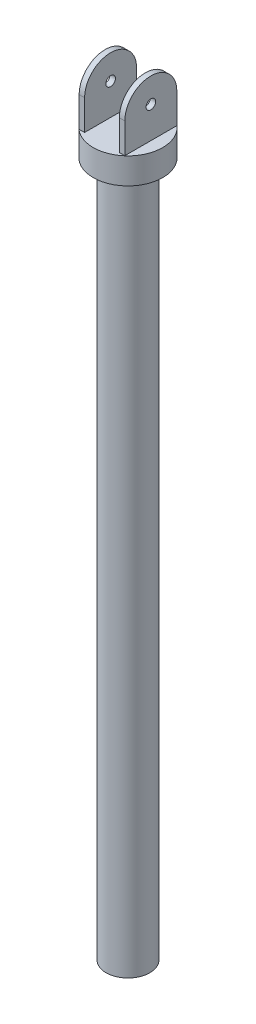
ISO-10303-21;
HEADER;
FILE_DESCRIPTION(('STEP AP214'),'2;1');
FILE_NAME('part.step','',(''),(''),'','','');
FILE_SCHEMA(('AUTOMOTIVE_DESIGN { 1 0 10303 214 1 1 1 1 }'));
ENDSEC;
DATA;
#1=APPLICATION_CONTEXT('core data for automotive mechanical design processes');
#2=APPLICATION_PROTOCOL_DEFINITION('international standard','automotive_design',2000,#1);
#3=PRODUCT_CONTEXT('',#1,'mechanical');
#4=PRODUCT('Part','Part','',(#3));
#5=PRODUCT_RELATED_PRODUCT_CATEGORY('part','',(#4));
#6=PRODUCT_DEFINITION_FORMATION('','',#4);
#7=PRODUCT_DEFINITION_CONTEXT('part definition',#1,'design');
#8=PRODUCT_DEFINITION('design','',#6,#7);
#9=PRODUCT_DEFINITION_SHAPE('','',#8);
#10=(LENGTH_UNIT() NAMED_UNIT(*) SI_UNIT(.MILLI.,.METRE.));
#11=(NAMED_UNIT(*) PLANE_ANGLE_UNIT() SI_UNIT($,.RADIAN.));
#12=(NAMED_UNIT(*) SI_UNIT($,.STERADIAN.) SOLID_ANGLE_UNIT());
#13=UNCERTAINTY_MEASURE_WITH_UNIT(LENGTH_MEASURE(1.E-05),#10,'distance_accuracy_value','');
#14=(GEOMETRIC_REPRESENTATION_CONTEXT(3) GLOBAL_UNCERTAINTY_ASSIGNED_CONTEXT((#13)) GLOBAL_UNIT_ASSIGNED_CONTEXT((#10,
#11,#12)) REPRESENTATION_CONTEXT('',''));
#15=CARTESIAN_POINT('',(0.,0.,0.));
#16=DIRECTION('',(0.,0.,1.));
#17=DIRECTION('',(1.,0.,0.));
#18=AXIS2_PLACEMENT_3D('',#15,#16,#17);
#19=CARTESIAN_POINT('',(0.,0.,0.));
#20=DIRECTION('',(0.,1.,0.));
#21=DIRECTION('',(0.,0.,1.));
#22=AXIS2_PLACEMENT_3D('',#19,#20,#21);
#23=PLANE('',#22);
#24=CARTESIAN_POINT('',(0.,0.,0.));
#25=DIRECTION('',(0.,1.,0.));
#26=DIRECTION('',(0.,0.,1.));
#27=AXIS2_PLACEMENT_3D('',#24,#25,#26);
#28=CIRCLE('',#27,25.4);
#29=CARTESIAN_POINT('',(0.,0.,25.4));
#30=VERTEX_POINT('',#29);
#31=EDGE_CURVE('E175',#30,#30,#28,.T.);
#32=ORIENTED_EDGE('',*,*,#31,.F.);
#33=EDGE_LOOP('',(#32));
#34=FACE_BOUND('',#33,.T.);
#35=CARTESIAN_POINT('',(0.,0.,0.));
#36=DIRECTION('',(0.,1.,0.));
#37=DIRECTION('',(0.,0.,1.));
#38=AXIS2_PLACEMENT_3D('',#35,#36,#37);
#39=CIRCLE('',#38,16.);
#40=CARTESIAN_POINT('',(0.,0.,16.));
#41=VERTEX_POINT('',#40);
#42=EDGE_CURVE('E11',#41,#41,#39,.F.);
#43=ORIENTED_EDGE('',*,*,#42,.F.);
#44=EDGE_LOOP('',(#43));
#45=FACE_BOUND('',#44,.T.);
#46=ADVANCED_FACE('F34',(#34,#45),#23,.F.);
#47=CARTESIAN_POINT('',(0.,19.05,0.));
#48=DIRECTION('',(0.,1.,0.));
#49=DIRECTION('',(0.,0.,1.));
#50=AXIS2_PLACEMENT_3D('',#47,#48,#49);
#51=PLANE('',#50);
#52=DIRECTION('',(0.,0.,-1.));
#53=VECTOR('',#52,1.);
#54=CARTESIAN_POINT('',(-16.7,19.05,19.));
#55=LINE('',#54,#53);
#56=CARTESIAN_POINT('',(-16.7,19.05,19.));
#57=VERTEX_POINT('',#56);
#58=CARTESIAN_POINT('',(-16.7,19.05,-19.));
#59=VERTEX_POINT('',#58);
#60=EDGE_CURVE('E117',#57,#59,#55,.T.);
#61=ORIENTED_EDGE('',*,*,#60,.T.);
#62=DIRECTION('',(1.,0.,0.));
#63=VECTOR('',#62,1.);
#64=CARTESIAN_POINT('',(-16.7,19.05,-19.));
#65=LINE('',#64,#63);
#66=CARTESIAN_POINT('',(-12.7,19.05,-19.));
#67=VERTEX_POINT('',#66);
#68=EDGE_CURVE('E138',#59,#67,#65,.T.);
#69=ORIENTED_EDGE('',*,*,#68,.T.);
#70=DIRECTION('',(0.,0.,-1.));
#71=VECTOR('',#70,1.);
#72=CARTESIAN_POINT('',(-12.7,19.05,19.));
#73=LINE('',#72,#71);
#74=CARTESIAN_POINT('',(-12.7,19.05,19.));
#75=VERTEX_POINT('',#74);
#76=EDGE_CURVE('E119',#75,#67,#73,.T.);
#77=ORIENTED_EDGE('',*,*,#76,.F.);
#78=DIRECTION('',(1.,0.,0.));
#79=VECTOR('',#78,1.);
#80=CARTESIAN_POINT('',(-16.7,19.05,19.));
#81=LINE('',#80,#79);
#82=EDGE_CURVE('E128',#57,#75,#81,.T.);
#83=ORIENTED_EDGE('',*,*,#82,.F.);
#84=EDGE_LOOP('',(#61,#69,#77,#83));
#85=FACE_BOUND('',#84,.T.);
#86=CARTESIAN_POINT('',(0.,19.05,0.));
#87=DIRECTION('',(0.,1.,0.));
#88=DIRECTION('',(0.,0.,1.));
#89=AXIS2_PLACEMENT_3D('',#86,#87,#88);
#90=CIRCLE('',#89,25.4);
#91=CARTESIAN_POINT('',(0.,19.05,25.4));
#92=VERTEX_POINT('',#91);
#93=EDGE_CURVE('E42',#92,#92,#90,.T.);
#94=ORIENTED_EDGE('',*,*,#93,.T.);
#95=EDGE_LOOP('',(#94));
#96=FACE_BOUND('',#95,.T.);
#97=DIRECTION('',(0.,0.,-1.));
#98=VECTOR('',#97,1.);
#99=CARTESIAN_POINT('',(16.7,19.05,19.));
#100=LINE('',#99,#98);
#101=CARTESIAN_POINT('',(16.7,19.05,19.));
#102=VERTEX_POINT('',#101);
#103=CARTESIAN_POINT('',(16.7,19.05,-19.));
#104=VERTEX_POINT('',#103);
#105=EDGE_CURVE('E150',#102,#104,#100,.T.);
#106=ORIENTED_EDGE('',*,*,#105,.F.);
#107=DIRECTION('',(-1.,0.,0.));
#108=VECTOR('',#107,1.);
#109=CARTESIAN_POINT('',(16.7,19.05,19.));
#110=LINE('',#109,#108);
#111=CARTESIAN_POINT('',(12.7,19.05,19.));
#112=VERTEX_POINT('',#111);
#113=EDGE_CURVE('E172',#102,#112,#110,.T.);
#114=ORIENTED_EDGE('',*,*,#113,.T.);
#115=DIRECTION('',(0.,0.,-1.));
#116=VECTOR('',#115,1.);
#117=CARTESIAN_POINT('',(12.7,19.05,19.));
#118=LINE('',#117,#116);
#119=CARTESIAN_POINT('',(12.7,19.05,-19.));
#120=VERTEX_POINT('',#119);
#121=EDGE_CURVE('E159',#112,#120,#118,.T.);
#122=ORIENTED_EDGE('',*,*,#121,.T.);
#123=DIRECTION('',(-1.,0.,0.));
#124=VECTOR('',#123,1.);
#125=CARTESIAN_POINT('',(16.7,19.05,-19.));
#126=LINE('',#125,#124);
#127=EDGE_CURVE('E170',#104,#120,#126,.T.);
#128=ORIENTED_EDGE('',*,*,#127,.F.);
#129=EDGE_LOOP('',(#106,#114,#122,#128));
#130=FACE_BOUND('',#129,.T.);
#131=ADVANCED_FACE('F183',(#85,#96,#130),#51,.T.);
#132=CARTESIAN_POINT('',(0.,19.05,0.));
#133=DIRECTION('',(0.,-1.,0.));
#134=DIRECTION('',(0.,0.,-1.));
#135=AXIS2_PLACEMENT_3D('',#132,#133,#134);
#136=CYLINDRICAL_SURFACE('',#135,25.4);
#137=ORIENTED_EDGE('',*,*,#93,.F.);
#138=EDGE_LOOP('',(#137));
#139=FACE_BOUND('',#138,.T.);
#140=ORIENTED_EDGE('',*,*,#31,.T.);
#141=EDGE_LOOP('',(#140));
#142=FACE_BOUND('',#141,.T.);
#143=ADVANCED_FACE('F36',(#139,#142),#136,.T.);
#144=CARTESIAN_POINT('',(16.7,41.05,0.));
#145=DIRECTION('',(1.,0.,0.));
#146=DIRECTION('',(0.,0.,-1.));
#147=AXIS2_PLACEMENT_3D('',#144,#145,#146);
#148=PLANE('',#147);
#149=DIRECTION('',(0.,-1.,0.));
#150=VECTOR('',#149,1.);
#151=CARTESIAN_POINT('',(16.7,41.05,19.));
#152=LINE('',#151,#150);
#153=CARTESIAN_POINT('',(16.7,41.05,19.));
#154=VERTEX_POINT('',#153);
#155=EDGE_CURVE('E148',#154,#102,#152,.T.);
#156=ORIENTED_EDGE('',*,*,#155,.T.);
#157=ORIENTED_EDGE('',*,*,#105,.T.);
#158=DIRECTION('',(0.,1.,0.));
#159=VECTOR('',#158,1.);
#160=CARTESIAN_POINT('',(16.7,19.05,-19.));
#161=LINE('',#160,#159);
#162=CARTESIAN_POINT('',(16.7,41.05,-19.));
#163=VERTEX_POINT('',#162);
#164=EDGE_CURVE('E57',#104,#163,#161,.T.);
#165=ORIENTED_EDGE('',*,*,#164,.T.);
#166=CARTESIAN_POINT('',(16.7,41.05,0.));
#167=DIRECTION('',(1.,0.,0.));
#168=DIRECTION('',(0.,0.,-1.));
#169=AXIS2_PLACEMENT_3D('',#166,#167,#168);
#170=CIRCLE('',#169,19.);
#171=EDGE_CURVE('E154',#163,#154,#170,.T.);
#172=ORIENTED_EDGE('',*,*,#171,.T.);
#173=EDGE_LOOP('',(#156,#157,#165,#172));
#174=FACE_BOUND('',#173,.T.);
#175=CARTESIAN_POINT('',(16.7,42.05,0.));
#176=DIRECTION('',(1.,0.,0.));
#177=DIRECTION('',(0.,0.,-1.));
#178=AXIS2_PLACEMENT_3D('',#175,#176,#177);
#179=CIRCLE('',#178,3.5);
#180=CARTESIAN_POINT('',(16.7,42.05,-3.5));
#181=VERTEX_POINT('',#180);
#182=EDGE_CURVE('E142',#181,#181,#179,.T.);
#183=ORIENTED_EDGE('',*,*,#182,.F.);
#184=EDGE_LOOP('',(#183));
#185=FACE_BOUND('',#184,.T.);
#186=ADVANCED_FACE('F222',(#174,#185),#148,.T.);
#187=CARTESIAN_POINT('',(12.7,41.05,0.));
#188=DIRECTION('',(1.,0.,0.));
#189=DIRECTION('',(0.,0.,-1.));
#190=AXIS2_PLACEMENT_3D('',#187,#188,#189);
#191=PLANE('',#190);
#192=DIRECTION('',(0.,-1.,0.));
#193=VECTOR('',#192,1.);
#194=CARTESIAN_POINT('',(12.7,41.05,19.));
#195=LINE('',#194,#193);
#196=CARTESIAN_POINT('',(12.7,41.05,19.));
#197=VERTEX_POINT('',#196);
#198=EDGE_CURVE('E145',#197,#112,#195,.T.);
#199=ORIENTED_EDGE('',*,*,#198,.F.);
#200=CARTESIAN_POINT('',(12.7,41.05,0.));
#201=DIRECTION('',(1.,0.,0.));
#202=DIRECTION('',(0.,0.,-1.));
#203=AXIS2_PLACEMENT_3D('',#200,#201,#202);
#204=CIRCLE('',#203,19.);
#205=CARTESIAN_POINT('',(12.7,41.05,-19.));
#206=VERTEX_POINT('',#205);
#207=EDGE_CURVE('E151',#206,#197,#204,.T.);
#208=ORIENTED_EDGE('',*,*,#207,.F.);
#209=DIRECTION('',(0.,1.,0.));
#210=VECTOR('',#209,1.);
#211=CARTESIAN_POINT('',(12.7,19.05,-19.));
#212=LINE('',#211,#210);
#213=EDGE_CURVE('E162',#120,#206,#212,.T.);
#214=ORIENTED_EDGE('',*,*,#213,.F.);
#215=ORIENTED_EDGE('',*,*,#121,.F.);
#216=EDGE_LOOP('',(#199,#208,#214,#215));
#217=FACE_BOUND('',#216,.T.);
#218=CARTESIAN_POINT('',(12.7,42.05,0.));
#219=DIRECTION('',(1.,0.,0.));
#220=DIRECTION('',(0.,0.,-1.));
#221=AXIS2_PLACEMENT_3D('',#218,#219,#220);
#222=CIRCLE('',#221,3.5);
#223=CARTESIAN_POINT('',(12.7,42.05,-3.5));
#224=VERTEX_POINT('',#223);
#225=EDGE_CURVE('E107',#224,#224,#222,.T.);
#226=ORIENTED_EDGE('',*,*,#225,.T.);
#227=EDGE_LOOP('',(#226));
#228=FACE_BOUND('',#227,.T.);
#229=ADVANCED_FACE('F225',(#217,#228),#191,.F.);
#230=CARTESIAN_POINT('',(16.7,41.05,19.));
#231=DIRECTION('',(0.,0.,-1.));
#232=DIRECTION('',(-1.,0.,0.));
#233=AXIS2_PLACEMENT_3D('',#230,#231,#232);
#234=PLANE('',#233);
#235=ORIENTED_EDGE('',*,*,#198,.T.);
#236=ORIENTED_EDGE('',*,*,#113,.F.);
#237=ORIENTED_EDGE('',*,*,#155,.F.);
#238=DIRECTION('',(-1.,0.,0.));
#239=VECTOR('',#238,1.);
#240=CARTESIAN_POINT('',(16.7,41.05,19.));
#241=LINE('',#240,#239);
#242=EDGE_CURVE('E156',#154,#197,#241,.T.);
#243=ORIENTED_EDGE('',*,*,#242,.T.);
#244=EDGE_LOOP('',(#235,#236,#237,#243));
#245=FACE_BOUND('',#244,.T.);
#246=ADVANCED_FACE('F229',(#245),#234,.F.);
#247=CARTESIAN_POINT('',(16.7,19.05,-19.));
#248=DIRECTION('',(0.,0.,1.));
#249=DIRECTION('',(1.,0.,0.));
#250=AXIS2_PLACEMENT_3D('',#247,#248,#249);
#251=PLANE('',#250);
#252=ORIENTED_EDGE('',*,*,#213,.T.);
#253=DIRECTION('',(-1.,0.,0.));
#254=VECTOR('',#253,1.);
#255=CARTESIAN_POINT('',(16.7,41.05,-19.));
#256=LINE('',#255,#254);
#257=EDGE_CURVE('E167',#163,#206,#256,.T.);
#258=ORIENTED_EDGE('',*,*,#257,.F.);
#259=ORIENTED_EDGE('',*,*,#164,.F.);
#260=ORIENTED_EDGE('',*,*,#127,.T.);
#261=EDGE_LOOP('',(#252,#258,#259,#260));
#262=FACE_BOUND('',#261,.T.);
#263=ADVANCED_FACE('F233',(#262),#251,.F.);
#264=CARTESIAN_POINT('',(16.7,41.05,0.));
#265=DIRECTION('',(-1.,0.,0.));
#266=DIRECTION('',(0.,0.,1.));
#267=AXIS2_PLACEMENT_3D('',#264,#265,#266);
#268=CYLINDRICAL_SURFACE('',#267,19.);
#269=ORIENTED_EDGE('',*,*,#207,.T.);
#270=ORIENTED_EDGE('',*,*,#242,.F.);
#271=ORIENTED_EDGE('',*,*,#171,.F.);
#272=ORIENTED_EDGE('',*,*,#257,.T.);
#273=EDGE_LOOP('',(#269,#270,#271,#272));
#274=FACE_BOUND('',#273,.T.);
#275=ADVANCED_FACE('F220',(#274),#268,.T.);
#276=CARTESIAN_POINT('',(16.7,42.05,0.));
#277=DIRECTION('',(-1.,0.,0.));
#278=DIRECTION('',(0.,0.,1.));
#279=AXIS2_PLACEMENT_3D('',#276,#277,#278);
#280=CYLINDRICAL_SURFACE('',#279,3.5);
#281=ORIENTED_EDGE('',*,*,#182,.T.);
#282=EDGE_LOOP('',(#281));
#283=FACE_BOUND('',#282,.T.);
#284=ORIENTED_EDGE('',*,*,#225,.F.);
#285=EDGE_LOOP('',(#284));
#286=FACE_BOUND('',#285,.T.);
#287=ADVANCED_FACE('F217',(#283,#286),#280,.F.);
#288=CARTESIAN_POINT('',(-16.7,41.05,19.));
#289=DIRECTION('',(0.,0.,1.));
#290=DIRECTION('',(1.,0.,0.));
#291=AXIS2_PLACEMENT_3D('',#288,#289,#290);
#292=PLANE('',#291);
#293=DIRECTION('',(0.,-1.,0.));
#294=VECTOR('',#293,1.);
#295=CARTESIAN_POINT('',(-12.7,41.05,19.));
#296=LINE('',#295,#294);
#297=CARTESIAN_POINT('',(-12.7,41.05,19.));
#298=VERTEX_POINT('',#297);
#299=EDGE_CURVE('E49',#298,#75,#296,.T.);
#300=ORIENTED_EDGE('',*,*,#299,.F.);
#301=DIRECTION('',(1.,0.,0.));
#302=VECTOR('',#301,1.);
#303=CARTESIAN_POINT('',(-16.7,41.05,19.));
#304=LINE('',#303,#302);
#305=CARTESIAN_POINT('',(-16.7,41.05,19.));
#306=VERTEX_POINT('',#305);
#307=EDGE_CURVE('E99',#306,#298,#304,.T.);
#308=ORIENTED_EDGE('',*,*,#307,.F.);
#309=DIRECTION('',(0.,-1.,0.));
#310=VECTOR('',#309,1.);
#311=CARTESIAN_POINT('',(-16.7,41.05,19.));
#312=LINE('',#311,#310);
#313=EDGE_CURVE('E102',#306,#57,#312,.T.);
#314=ORIENTED_EDGE('',*,*,#313,.T.);
#315=ORIENTED_EDGE('',*,*,#82,.T.);
#316=EDGE_LOOP('',(#300,#308,#314,#315));
#317=FACE_BOUND('',#316,.T.);
#318=ADVANCED_FACE('F101',(#317),#292,.T.);
#319=CARTESIAN_POINT('',(-16.7,41.05,0.));
#320=DIRECTION('',(1.,0.,0.));
#321=DIRECTION('',(0.,0.,-1.));
#322=AXIS2_PLACEMENT_3D('',#319,#320,#321);
#323=CYLINDRICAL_SURFACE('',#322,19.);
#324=CARTESIAN_POINT('',(-12.7,41.05,0.));
#325=DIRECTION('',(1.,0.,0.));
#326=DIRECTION('',(0.,0.,-1.));
#327=AXIS2_PLACEMENT_3D('',#324,#325,#326);
#328=CIRCLE('',#327,19.);
#329=CARTESIAN_POINT('',(-12.7,41.05,-19.));
#330=VERTEX_POINT('',#329);
#331=EDGE_CURVE('E130',#330,#298,#328,.T.);
#332=ORIENTED_EDGE('',*,*,#331,.F.);
#333=DIRECTION('',(1.,0.,0.));
#334=VECTOR('',#333,1.);
#335=CARTESIAN_POINT('',(-16.7,41.05,-19.));
#336=LINE('',#335,#334);
#337=CARTESIAN_POINT('',(-16.7,41.05,-19.));
#338=VERTEX_POINT('',#337);
#339=EDGE_CURVE('E108',#338,#330,#336,.T.);
#340=ORIENTED_EDGE('',*,*,#339,.F.);
#341=CARTESIAN_POINT('',(-16.7,41.05,0.));
#342=DIRECTION('',(1.,0.,0.));
#343=DIRECTION('',(0.,0.,-1.));
#344=AXIS2_PLACEMENT_3D('',#341,#342,#343);
#345=CIRCLE('',#344,19.);
#346=EDGE_CURVE('E114',#338,#306,#345,.T.);
#347=ORIENTED_EDGE('',*,*,#346,.T.);
#348=ORIENTED_EDGE('',*,*,#307,.T.);
#349=EDGE_LOOP('',(#332,#340,#347,#348));
#350=FACE_BOUND('',#349,.T.);
#351=ADVANCED_FACE('F121',(#350),#323,.T.);
#352=CARTESIAN_POINT('',(-16.7,19.05,-19.));
#353=DIRECTION('',(0.,0.,-1.));
#354=DIRECTION('',(-1.,0.,0.));
#355=AXIS2_PLACEMENT_3D('',#352,#353,#354);
#356=PLANE('',#355);
#357=DIRECTION('',(0.,1.,0.));
#358=VECTOR('',#357,1.);
#359=CARTESIAN_POINT('',(-12.7,19.05,-19.));
#360=LINE('',#359,#358);
#361=EDGE_CURVE('E133',#67,#330,#360,.T.);
#362=ORIENTED_EDGE('',*,*,#361,.F.);
#363=ORIENTED_EDGE('',*,*,#68,.F.);
#364=DIRECTION('',(0.,1.,0.));
#365=VECTOR('',#364,1.);
#366=CARTESIAN_POINT('',(-16.7,19.05,-19.));
#367=LINE('',#366,#365);
#368=EDGE_CURVE('E122',#59,#338,#367,.T.);
#369=ORIENTED_EDGE('',*,*,#368,.T.);
#370=ORIENTED_EDGE('',*,*,#339,.T.);
#371=EDGE_LOOP('',(#362,#363,#369,#370));
#372=FACE_BOUND('',#371,.T.);
#373=ADVANCED_FACE('F205',(#372),#356,.T.);
#374=CARTESIAN_POINT('',(-16.7,41.05,0.));
#375=DIRECTION('',(-1.,0.,0.));
#376=DIRECTION('',(0.,0.,-1.));
#377=AXIS2_PLACEMENT_3D('',#374,#375,#376);
#378=PLANE('',#377);
#379=CARTESIAN_POINT('',(-16.7,42.05,0.));
#380=DIRECTION('',(1.,0.,0.));
#381=DIRECTION('',(0.,0.,-1.));
#382=AXIS2_PLACEMENT_3D('',#379,#380,#381);
#383=CIRCLE('',#382,3.5);
#384=CARTESIAN_POINT('',(-16.7,42.05,-3.5));
#385=VERTEX_POINT('',#384);
#386=EDGE_CURVE('E131',#385,#385,#383,.T.);
#387=ORIENTED_EDGE('',*,*,#386,.T.);
#388=EDGE_LOOP('',(#387));
#389=FACE_BOUND('',#388,.T.);
#390=ORIENTED_EDGE('',*,*,#313,.F.);
#391=ORIENTED_EDGE('',*,*,#346,.F.);
#392=ORIENTED_EDGE('',*,*,#368,.F.);
#393=ORIENTED_EDGE('',*,*,#60,.F.);
#394=EDGE_LOOP('',(#390,#391,#392,#393));
#395=FACE_BOUND('',#394,.T.);
#396=ADVANCED_FACE('F112',(#389,#395),#378,.T.);
#397=CARTESIAN_POINT('',(-12.7,41.05,0.));
#398=DIRECTION('',(-1.,0.,0.));
#399=DIRECTION('',(0.,0.,-1.));
#400=AXIS2_PLACEMENT_3D('',#397,#398,#399);
#401=PLANE('',#400);
#402=CARTESIAN_POINT('',(-12.7,42.05,0.));
#403=DIRECTION('',(1.,0.,0.));
#404=DIRECTION('',(0.,0.,-1.));
#405=AXIS2_PLACEMENT_3D('',#402,#403,#404);
#406=CIRCLE('',#405,3.5);
#407=CARTESIAN_POINT('',(-12.7,42.05,-3.5));
#408=VERTEX_POINT('',#407);
#409=EDGE_CURVE('E364',#408,#408,#406,.T.);
#410=ORIENTED_EDGE('',*,*,#409,.F.);
#411=EDGE_LOOP('',(#410));
#412=FACE_BOUND('',#411,.T.);
#413=ORIENTED_EDGE('',*,*,#299,.T.);
#414=ORIENTED_EDGE('',*,*,#76,.T.);
#415=ORIENTED_EDGE('',*,*,#361,.T.);
#416=ORIENTED_EDGE('',*,*,#331,.T.);
#417=EDGE_LOOP('',(#413,#414,#415,#416));
#418=FACE_BOUND('',#417,.T.);
#419=ADVANCED_FACE('F198',(#412,#418),#401,.F.);
#420=CARTESIAN_POINT('',(-16.7,42.05,0.));
#421=DIRECTION('',(1.,0.,0.));
#422=DIRECTION('',(0.,0.,-1.));
#423=AXIS2_PLACEMENT_3D('',#420,#421,#422);
#424=CYLINDRICAL_SURFACE('',#423,3.5);
#425=ORIENTED_EDGE('',*,*,#386,.F.);
#426=EDGE_LOOP('',(#425));
#427=FACE_BOUND('',#426,.T.);
#428=ORIENTED_EDGE('',*,*,#409,.T.);
#429=EDGE_LOOP('',(#428));
#430=FACE_BOUND('',#429,.T.);
#431=ADVANCED_FACE('F189',(#427,#430),#424,.F.);
#432=CARTESIAN_POINT('',(0.,-508.,0.));
#433=DIRECTION('',(0.,1.,0.));
#434=DIRECTION('',(0.,0.,1.));
#435=AXIS2_PLACEMENT_3D('',#432,#433,#434);
#436=CYLINDRICAL_SURFACE('',#435,16.);
#437=CARTESIAN_POINT('',(0.,-508.,0.));
#438=DIRECTION('',(0.,-1.,0.));
#439=DIRECTION('',(0.,0.,-1.));
#440=AXIS2_PLACEMENT_3D('',#437,#438,#439);
#441=CIRCLE('',#440,16.);
#442=CARTESIAN_POINT('',(0.,-508.,-16.));
#443=VERTEX_POINT('',#442);
#444=EDGE_CURVE('E366',#443,#443,#441,.T.);
#445=ORIENTED_EDGE('',*,*,#444,.F.);
#446=EDGE_LOOP('',(#445));
#447=FACE_BOUND('',#446,.T.);
#448=ORIENTED_EDGE('',*,*,#42,.T.);
#449=EDGE_LOOP('',(#448));
#450=FACE_BOUND('',#449,.T.);
#451=ADVANCED_FACE('F186',(#447,#450),#436,.T.);
#452=CARTESIAN_POINT('',(0.,-508.,0.));
#453=DIRECTION('',(0.,-1.,0.));
#454=DIRECTION('',(0.,0.,-1.));
#455=AXIS2_PLACEMENT_3D('',#452,#453,#454);
#456=PLANE('',#455);
#457=ORIENTED_EDGE('',*,*,#444,.T.);
#458=EDGE_LOOP('',(#457));
#459=FACE_BOUND('',#458,.T.);
#460=ADVANCED_FACE('F188',(#459),#456,.T.);
#461=CLOSED_SHELL('',(#46,#131,#143,#186,#229,#246,#263,#275,#287,#318,#351,#373,#396,#419,#431,
#451,#460));
#462=MANIFOLD_SOLID_BREP('B2',#461);
#463=ADVANCED_BREP_SHAPE_REPRESENTATION('',(#18,#462),#14);
#464=SHAPE_DEFINITION_REPRESENTATION(#9,#463);
ENDSEC;
END-ISO-10303-21;
